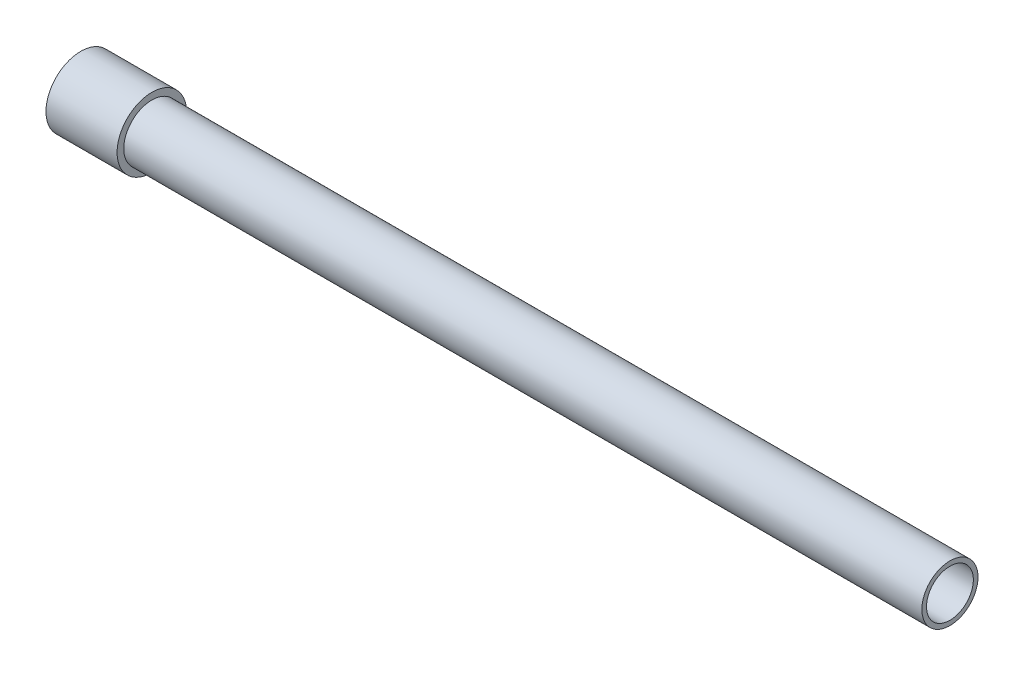
ISO-10303-21;
HEADER;
FILE_DESCRIPTION(('STEP AP214'),'2;1');
FILE_NAME('part.step','',(''),(''),'','','');
FILE_SCHEMA(('AUTOMOTIVE_DESIGN { 1 0 10303 214 1 1 1 1 }'));
ENDSEC;
DATA;
#1=APPLICATION_CONTEXT('core data for automotive mechanical design processes');
#2=APPLICATION_PROTOCOL_DEFINITION('international standard','automotive_design',2000,#1);
#3=PRODUCT_CONTEXT('',#1,'mechanical');
#4=PRODUCT('Part','Part','',(#3));
#5=PRODUCT_RELATED_PRODUCT_CATEGORY('part','',(#4));
#6=PRODUCT_DEFINITION_FORMATION('','',#4);
#7=PRODUCT_DEFINITION_CONTEXT('part definition',#1,'design');
#8=PRODUCT_DEFINITION('design','',#6,#7);
#9=PRODUCT_DEFINITION_SHAPE('','',#8);
#10=(LENGTH_UNIT() NAMED_UNIT(*) SI_UNIT(.MILLI.,.METRE.));
#11=(NAMED_UNIT(*) PLANE_ANGLE_UNIT() SI_UNIT($,.RADIAN.));
#12=(NAMED_UNIT(*) SI_UNIT($,.STERADIAN.) SOLID_ANGLE_UNIT());
#13=UNCERTAINTY_MEASURE_WITH_UNIT(LENGTH_MEASURE(1.E-05),#10,'distance_accuracy_value','');
#14=(GEOMETRIC_REPRESENTATION_CONTEXT(3) GLOBAL_UNCERTAINTY_ASSIGNED_CONTEXT((#13)) GLOBAL_UNIT_ASSIGNED_CONTEXT((#10,
#11,#12)) REPRESENTATION_CONTEXT('',''));
#15=CARTESIAN_POINT('',(0.,0.,0.));
#16=DIRECTION('',(0.,0.,1.));
#17=DIRECTION('',(1.,0.,0.));
#18=AXIS2_PLACEMENT_3D('',#15,#16,#17);
#19=CARTESIAN_POINT('',(-121.75,0.,0.));
#20=DIRECTION('',(-1.,0.,0.));
#21=DIRECTION('',(0.,0.,1.));
#22=AXIS2_PLACEMENT_3D('',#19,#20,#21);
#23=CYLINDRICAL_SURFACE('',#22,11.65);
#24=CARTESIAN_POINT('',(-121.75,0.,0.));
#25=DIRECTION('',(-1.,0.,0.));
#26=DIRECTION('',(0.,0.,1.));
#27=AXIS2_PLACEMENT_3D('',#24,#25,#26);
#28=CIRCLE('',#27,11.65);
#29=CARTESIAN_POINT('',(-121.75,0.,11.65));
#30=VERTEX_POINT('',#29);
#31=EDGE_CURVE('E11',#30,#30,#28,.T.);
#32=ORIENTED_EDGE('',*,*,#31,.T.);
#33=EDGE_LOOP('',(#32));
#34=FACE_BOUND('',#33,.T.);
#35=CARTESIAN_POINT('',(-145.55,0.,0.));
#36=DIRECTION('',(-1.,0.,0.));
#37=DIRECTION('',(0.,0.,1.));
#38=AXIS2_PLACEMENT_3D('',#35,#36,#37);
#39=CIRCLE('',#38,11.65);
#40=CARTESIAN_POINT('',(-145.55,0.,11.65));
#41=VERTEX_POINT('',#40);
#42=EDGE_CURVE('E42',#41,#41,#39,.T.);
#43=ORIENTED_EDGE('',*,*,#42,.F.);
#44=EDGE_LOOP('',(#43));
#45=FACE_BOUND('',#44,.T.);
#46=ADVANCED_FACE('F39',(#34,#45),#23,.T.);
#47=CARTESIAN_POINT('',(-121.75,0.,0.));
#48=DIRECTION('',(-1.,0.,0.));
#49=DIRECTION('',(0.,0.,1.));
#50=AXIS2_PLACEMENT_3D('',#47,#48,#49);
#51=PLANE('',#50);
#52=CARTESIAN_POINT('',(-121.75,0.,0.));
#53=DIRECTION('',(-1.,0.,0.));
#54=DIRECTION('',(0.,0.,1.));
#55=AXIS2_PLACEMENT_3D('',#52,#53,#54);
#56=CIRCLE('',#55,9.4);
#57=CARTESIAN_POINT('',(-121.75,0.,9.4));
#58=VERTEX_POINT('',#57);
#59=EDGE_CURVE('E49',#58,#58,#56,.T.);
#60=ORIENTED_EDGE('',*,*,#59,.T.);
#61=EDGE_LOOP('',(#60));
#62=FACE_BOUND('',#61,.T.);
#63=ORIENTED_EDGE('',*,*,#31,.F.);
#64=EDGE_LOOP('',(#63));
#65=FACE_BOUND('',#64,.T.);
#66=ADVANCED_FACE('F57',(#62,#65),#51,.F.);
#67=CARTESIAN_POINT('',(-145.55,0.,0.));
#68=DIRECTION('',(-1.,0.,0.));
#69=DIRECTION('',(0.,0.,1.));
#70=AXIS2_PLACEMENT_3D('',#67,#68,#69);
#71=PLANE('',#70);
#72=CARTESIAN_POINT('',(-145.55,0.,0.));
#73=DIRECTION('',(-1.,0.,0.));
#74=DIRECTION('',(0.,0.,1.));
#75=AXIS2_PLACEMENT_3D('',#72,#73,#74);
#76=CIRCLE('',#75,9.4);
#77=CARTESIAN_POINT('',(-145.55,0.,9.4));
#78=VERTEX_POINT('',#77);
#79=EDGE_CURVE('E51',#78,#78,#76,.T.);
#80=ORIENTED_EDGE('',*,*,#79,.F.);
#81=EDGE_LOOP('',(#80));
#82=FACE_BOUND('',#81,.T.);
#83=ORIENTED_EDGE('',*,*,#42,.T.);
#84=EDGE_LOOP('',(#83));
#85=FACE_BOUND('',#84,.T.);
#86=ADVANCED_FACE('F63',(#82,#85),#71,.T.);
#87=CARTESIAN_POINT('',(-121.75,0.,0.));
#88=DIRECTION('',(-1.,0.,0.));
#89=DIRECTION('',(0.,0.,1.));
#90=AXIS2_PLACEMENT_3D('',#87,#88,#89);
#91=CYLINDRICAL_SURFACE('',#90,9.4);
#92=ORIENTED_EDGE('',*,*,#59,.F.);
#93=EDGE_LOOP('',(#92));
#94=FACE_BOUND('',#93,.T.);
#95=ORIENTED_EDGE('',*,*,#79,.T.);
#96=EDGE_LOOP('',(#95));
#97=FACE_BOUND('',#96,.T.);
#98=ADVANCED_FACE('F60',(#94,#97),#91,.F.);
#99=CLOSED_SHELL('',(#46,#66,#86,#98));
#100=MANIFOLD_SOLID_BREP('B2',#99);
#101=CARTESIAN_POINT('',(145.55,0.,0.));
#102=DIRECTION('',(1.,0.,0.));
#103=DIRECTION('',(0.,0.,-1.));
#104=AXIS2_PLACEMENT_3D('',#101,#102,#103);
#105=PLANE('',#104);
#106=CARTESIAN_POINT('',(145.55,0.,0.));
#107=DIRECTION('',(1.,0.,0.));
#108=DIRECTION('',(0.,0.,-1.));
#109=AXIS2_PLACEMENT_3D('',#106,#107,#108);
#110=CIRCLE('',#109,9.4);
#111=CARTESIAN_POINT('',(145.55,0.,-9.4));
#112=VERTEX_POINT('',#111);
#113=EDGE_CURVE('E38',#112,#112,#110,.T.);
#114=ORIENTED_EDGE('',*,*,#113,.T.);
#115=EDGE_LOOP('',(#114));
#116=FACE_BOUND('',#115,.T.);
#117=CARTESIAN_POINT('',(145.55,0.,0.));
#118=DIRECTION('',(1.,0.,0.));
#119=DIRECTION('',(0.,0.,-1.));
#120=AXIS2_PLACEMENT_3D('',#117,#118,#119);
#121=CIRCLE('',#120,7.85);
#122=CARTESIAN_POINT('',(145.55,0.,-7.85));
#123=VERTEX_POINT('',#122);
#124=EDGE_CURVE('E112',#123,#123,#121,.T.);
#125=ORIENTED_EDGE('',*,*,#124,.F.);
#126=EDGE_LOOP('',(#125));
#127=FACE_BOUND('',#126,.T.);
#128=ADVANCED_FACE('F101',(#116,#127),#105,.T.);
#129=CARTESIAN_POINT('',(-145.55,0.,0.));
#130=DIRECTION('',(1.,0.,0.));
#131=DIRECTION('',(0.,0.,-1.));
#132=AXIS2_PLACEMENT_3D('',#129,#130,#131);
#133=PLANE('',#132);
#134=CARTESIAN_POINT('',(-145.55,0.,0.));
#135=DIRECTION('',(1.,0.,0.));
#136=DIRECTION('',(0.,0.,-1.));
#137=AXIS2_PLACEMENT_3D('',#134,#135,#136);
#138=CIRCLE('',#137,9.4);
#139=CARTESIAN_POINT('',(-145.55,0.,-9.4));
#140=VERTEX_POINT('',#139);
#141=EDGE_CURVE('E105',#140,#140,#138,.T.);
#142=ORIENTED_EDGE('',*,*,#141,.F.);
#143=EDGE_LOOP('',(#142));
#144=FACE_BOUND('',#143,.T.);
#145=CARTESIAN_POINT('',(-145.55,0.,0.));
#146=DIRECTION('',(1.,0.,0.));
#147=DIRECTION('',(0.,0.,-1.));
#148=AXIS2_PLACEMENT_3D('',#145,#146,#147);
#149=CIRCLE('',#148,7.85);
#150=CARTESIAN_POINT('',(-145.55,0.,-7.85));
#151=VERTEX_POINT('',#150);
#152=EDGE_CURVE('E114',#151,#151,#149,.T.);
#153=ORIENTED_EDGE('',*,*,#152,.T.);
#154=EDGE_LOOP('',(#153));
#155=FACE_BOUND('',#154,.T.);
#156=ADVANCED_FACE('F124',(#144,#155),#133,.F.);
#157=CARTESIAN_POINT('',(145.55,0.,0.));
#158=DIRECTION('',(-1.,0.,0.));
#159=DIRECTION('',(0.,0.,1.));
#160=AXIS2_PLACEMENT_3D('',#157,#158,#159);
#161=CYLINDRICAL_SURFACE('',#160,9.4);
#162=ORIENTED_EDGE('',*,*,#113,.F.);
#163=EDGE_LOOP('',(#162));
#164=FACE_BOUND('',#163,.T.);
#165=ORIENTED_EDGE('',*,*,#141,.T.);
#166=EDGE_LOOP('',(#165));
#167=FACE_BOUND('',#166,.T.);
#168=ADVANCED_FACE('F103',(#164,#167),#161,.T.);
#169=CARTESIAN_POINT('',(145.55,0.,0.));
#170=DIRECTION('',(-1.,0.,0.));
#171=DIRECTION('',(0.,0.,1.));
#172=AXIS2_PLACEMENT_3D('',#169,#170,#171);
#173=CYLINDRICAL_SURFACE('',#172,7.85);
#174=ORIENTED_EDGE('',*,*,#124,.T.);
#175=EDGE_LOOP('',(#174));
#176=FACE_BOUND('',#175,.T.);
#177=ORIENTED_EDGE('',*,*,#152,.F.);
#178=EDGE_LOOP('',(#177));
#179=FACE_BOUND('',#178,.T.);
#180=ADVANCED_FACE('F120',(#176,#179),#173,.F.);
#181=CLOSED_SHELL('',(#128,#156,#168,#180));
#182=MANIFOLD_SOLID_BREP('B6',#181);
#183=ADVANCED_BREP_SHAPE_REPRESENTATION('',(#18,#100,#182),#14);
#184=SHAPE_DEFINITION_REPRESENTATION(#9,#183);
ENDSEC;
END-ISO-10303-21;
